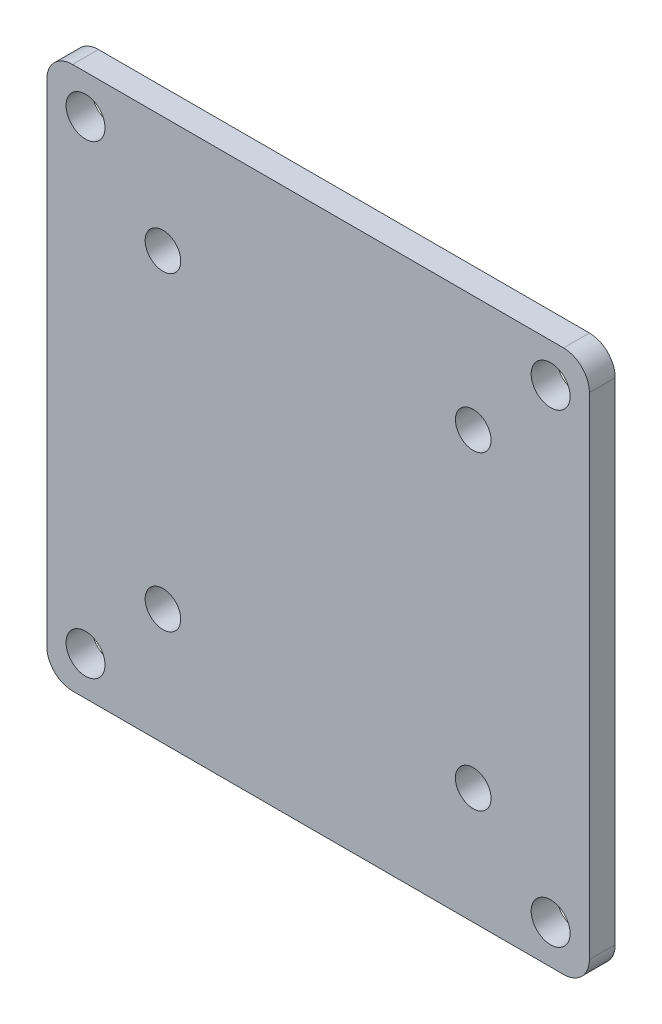
ISO-10303-21;
HEADER;
FILE_DESCRIPTION(('STEP AP214'),'2;1');
FILE_NAME('part.step','',(''),(''),'','','');
FILE_SCHEMA(('AUTOMOTIVE_DESIGN { 1 0 10303 214 1 1 1 1 }'));
ENDSEC;
DATA;
#1=APPLICATION_CONTEXT('core data for automotive mechanical design processes');
#2=APPLICATION_PROTOCOL_DEFINITION('international standard','automotive_design',2000,#1);
#3=PRODUCT_CONTEXT('',#1,'mechanical');
#4=PRODUCT('Part','Part','',(#3));
#5=PRODUCT_RELATED_PRODUCT_CATEGORY('part','',(#4));
#6=PRODUCT_DEFINITION_FORMATION('','',#4);
#7=PRODUCT_DEFINITION_CONTEXT('part definition',#1,'design');
#8=PRODUCT_DEFINITION('design','',#6,#7);
#9=PRODUCT_DEFINITION_SHAPE('','',#8);
#10=(LENGTH_UNIT() NAMED_UNIT(*) SI_UNIT(.MILLI.,.METRE.));
#11=(NAMED_UNIT(*) PLANE_ANGLE_UNIT() SI_UNIT($,.RADIAN.));
#12=(NAMED_UNIT(*) SI_UNIT($,.STERADIAN.) SOLID_ANGLE_UNIT());
#13=UNCERTAINTY_MEASURE_WITH_UNIT(LENGTH_MEASURE(1.E-05),#10,'distance_accuracy_value','');
#14=(GEOMETRIC_REPRESENTATION_CONTEXT(3) GLOBAL_UNCERTAINTY_ASSIGNED_CONTEXT((#13)) GLOBAL_UNIT_ASSIGNED_CONTEXT((#10,
#11,#12)) REPRESENTATION_CONTEXT('',''));
#15=CARTESIAN_POINT('',(0.,0.,0.));
#16=DIRECTION('',(0.,0.,1.));
#17=DIRECTION('',(1.,0.,0.));
#18=AXIS2_PLACEMENT_3D('',#15,#16,#17);
#19=CARTESIAN_POINT('',(0.,0.,2.54));
#20=DIRECTION('',(0.,0.,1.));
#21=DIRECTION('',(1.,0.,0.));
#22=AXIS2_PLACEMENT_3D('',#19,#20,#21);
#23=PLANE('',#22);
#24=CARTESIAN_POINT('',(15.2499999999999,15.25,2.54));
#25=DIRECTION('',(0.,0.,1.));
#26=DIRECTION('',(1.,0.,0.));
#27=AXIS2_PLACEMENT_3D('',#24,#25,#26);
#28=CIRCLE('',#27,1.75);
#29=CARTESIAN_POINT('',(16.9999999999999,15.25,2.54));
#30=VERTEX_POINT('',#29);
#31=EDGE_CURVE('E220',#30,#30,#28,.T.);
#32=ORIENTED_EDGE('',*,*,#31,.F.);
#33=EDGE_LOOP('',(#32));
#34=FACE_BOUND('',#33,.T.);
#35=CARTESIAN_POINT('',(-15.2500000000002,15.25,2.54));
#36=DIRECTION('',(0.,0.,1.));
#37=DIRECTION('',(1.,0.,0.));
#38=AXIS2_PLACEMENT_3D('',#35,#36,#37);
#39=CIRCLE('',#38,1.75);
#40=CARTESIAN_POINT('',(-13.5000000000002,15.25,2.54));
#41=VERTEX_POINT('',#40);
#42=EDGE_CURVE('E208',#41,#41,#39,.T.);
#43=ORIENTED_EDGE('',*,*,#42,.F.);
#44=EDGE_LOOP('',(#43));
#45=FACE_BOUND('',#44,.T.);
#46=CARTESIAN_POINT('',(-22.86,22.86,2.54));
#47=DIRECTION('',(0.,0.,1.));
#48=DIRECTION('',(1.,0.,0.));
#49=AXIS2_PLACEMENT_3D('',#46,#47,#48);
#50=CIRCLE('',#49,1.9145);
#51=CARTESIAN_POINT('',(-20.9455,22.86,2.54));
#52=VERTEX_POINT('',#51);
#53=EDGE_CURVE('E196',#52,#52,#50,.T.);
#54=ORIENTED_EDGE('',*,*,#53,.F.);
#55=EDGE_LOOP('',(#54));
#56=FACE_BOUND('',#55,.T.);
#57=CARTESIAN_POINT('',(22.86,-22.86,2.54));
#58=DIRECTION('',(0.,0.,1.));
#59=DIRECTION('',(1.,0.,0.));
#60=AXIS2_PLACEMENT_3D('',#57,#58,#59);
#61=CIRCLE('',#60,1.9145);
#62=CARTESIAN_POINT('',(24.7745,-22.86,2.54));
#63=VERTEX_POINT('',#62);
#64=EDGE_CURVE('E142',#63,#63,#61,.T.);
#65=ORIENTED_EDGE('',*,*,#64,.F.);
#66=EDGE_LOOP('',(#65));
#67=FACE_BOUND('',#66,.T.);
#68=DIRECTION('',(1.,0.,0.));
#69=VECTOR('',#68,1.);
#70=CARTESIAN_POINT('',(26.67,-26.67,2.54));
#71=LINE('',#70,#69);
#72=CARTESIAN_POINT('',(-24.13,-26.67,2.54));
#73=VERTEX_POINT('',#72);
#74=CARTESIAN_POINT('',(24.13,-26.67,2.54));
#75=VERTEX_POINT('',#74);
#76=EDGE_CURVE('E147',#73,#75,#71,.T.);
#77=ORIENTED_EDGE('',*,*,#76,.T.);
#78=CARTESIAN_POINT('',(24.13,-24.13,2.54));
#79=DIRECTION('',(0.,0.,1.));
#80=DIRECTION('',(1.,0.,0.));
#81=AXIS2_PLACEMENT_3D('',#78,#79,#80);
#82=CIRCLE('',#81,2.54);
#83=CARTESIAN_POINT('',(26.67,-24.13,2.54));
#84=VERTEX_POINT('',#83);
#85=EDGE_CURVE('E162',#75,#84,#82,.T.);
#86=ORIENTED_EDGE('',*,*,#85,.T.);
#87=DIRECTION('',(0.,1.,0.));
#88=VECTOR('',#87,1.);
#89=CARTESIAN_POINT('',(26.67,26.67,2.54));
#90=LINE('',#89,#88);
#91=CARTESIAN_POINT('',(26.67,24.13,2.54));
#92=VERTEX_POINT('',#91);
#93=EDGE_CURVE('E129',#84,#92,#90,.T.);
#94=ORIENTED_EDGE('',*,*,#93,.T.);
#95=CARTESIAN_POINT('',(24.13,24.13,2.54));
#96=DIRECTION('',(0.,0.,1.));
#97=DIRECTION('',(1.,0.,0.));
#98=AXIS2_PLACEMENT_3D('',#95,#96,#97);
#99=CIRCLE('',#98,2.54);
#100=CARTESIAN_POINT('',(24.13,26.67,2.54));
#101=VERTEX_POINT('',#100);
#102=EDGE_CURVE('E157',#92,#101,#99,.T.);
#103=ORIENTED_EDGE('',*,*,#102,.T.);
#104=DIRECTION('',(-1.,0.,0.));
#105=VECTOR('',#104,1.);
#106=CARTESIAN_POINT('',(26.67,26.67,2.54));
#107=LINE('',#106,#105);
#108=CARTESIAN_POINT('',(-24.13,26.67,2.54));
#109=VERTEX_POINT('',#108);
#110=EDGE_CURVE('E173',#101,#109,#107,.T.);
#111=ORIENTED_EDGE('',*,*,#110,.T.);
#112=CARTESIAN_POINT('',(-24.13,24.13,2.54));
#113=DIRECTION('',(0.,0.,1.));
#114=DIRECTION('',(1.,0.,0.));
#115=AXIS2_PLACEMENT_3D('',#112,#113,#114);
#116=CIRCLE('',#115,2.54);
#117=CARTESIAN_POINT('',(-26.67,24.13,2.54));
#118=VERTEX_POINT('',#117);
#119=EDGE_CURVE('E65',#109,#118,#116,.T.);
#120=ORIENTED_EDGE('',*,*,#119,.T.);
#121=DIRECTION('',(0.,-1.,0.));
#122=VECTOR('',#121,1.);
#123=CARTESIAN_POINT('',(-26.67,26.67,2.54));
#124=LINE('',#123,#122);
#125=CARTESIAN_POINT('',(-26.67,-24.13,2.54));
#126=VERTEX_POINT('',#125);
#127=EDGE_CURVE('E148',#118,#126,#124,.T.);
#128=ORIENTED_EDGE('',*,*,#127,.T.);
#129=CARTESIAN_POINT('',(-24.13,-24.13,2.54));
#130=DIRECTION('',(0.,0.,1.));
#131=DIRECTION('',(1.,0.,0.));
#132=AXIS2_PLACEMENT_3D('',#129,#130,#131);
#133=CIRCLE('',#132,2.54);
#134=EDGE_CURVE('E160',#126,#73,#133,.T.);
#135=ORIENTED_EDGE('',*,*,#134,.T.);
#136=EDGE_LOOP('',(#77,#86,#94,#103,#111,#120,#128,#135));
#137=FACE_BOUND('',#136,.T.);
#138=CARTESIAN_POINT('',(22.86,22.86,2.54));
#139=DIRECTION('',(0.,0.,1.));
#140=DIRECTION('',(1.,0.,0.));
#141=AXIS2_PLACEMENT_3D('',#138,#139,#140);
#142=CIRCLE('',#141,1.9145);
#143=CARTESIAN_POINT('',(24.7745,22.86,2.54));
#144=VERTEX_POINT('',#143);
#145=EDGE_CURVE('E190',#144,#144,#142,.T.);
#146=ORIENTED_EDGE('',*,*,#145,.F.);
#147=EDGE_LOOP('',(#146));
#148=FACE_BOUND('',#147,.T.);
#149=CARTESIAN_POINT('',(-22.86,-22.86,2.54));
#150=DIRECTION('',(0.,0.,1.));
#151=DIRECTION('',(1.,0.,0.));
#152=AXIS2_PLACEMENT_3D('',#149,#150,#151);
#153=CIRCLE('',#152,1.9145);
#154=CARTESIAN_POINT('',(-20.9455,-22.86,2.54));
#155=VERTEX_POINT('',#154);
#156=EDGE_CURVE('E202',#155,#155,#153,.T.);
#157=ORIENTED_EDGE('',*,*,#156,.F.);
#158=EDGE_LOOP('',(#157));
#159=FACE_BOUND('',#158,.T.);
#160=CARTESIAN_POINT('',(-15.2500000000002,-15.25,2.54));
#161=DIRECTION('',(0.,0.,1.));
#162=DIRECTION('',(1.,0.,0.));
#163=AXIS2_PLACEMENT_3D('',#160,#161,#162);
#164=CIRCLE('',#163,1.75);
#165=CARTESIAN_POINT('',(-13.5000000000002,-15.25,2.54));
#166=VERTEX_POINT('',#165);
#167=EDGE_CURVE('E214',#166,#166,#164,.T.);
#168=ORIENTED_EDGE('',*,*,#167,.F.);
#169=EDGE_LOOP('',(#168));
#170=FACE_BOUND('',#169,.T.);
#171=CARTESIAN_POINT('',(15.2499999999999,-15.25,2.54));
#172=DIRECTION('',(0.,0.,1.));
#173=DIRECTION('',(1.,0.,0.));
#174=AXIS2_PLACEMENT_3D('',#171,#172,#173);
#175=CIRCLE('',#174,1.75);
#176=CARTESIAN_POINT('',(16.9999999999999,-15.25,2.54));
#177=VERTEX_POINT('',#176);
#178=EDGE_CURVE('E226',#177,#177,#175,.T.);
#179=ORIENTED_EDGE('',*,*,#178,.F.);
#180=EDGE_LOOP('',(#179));
#181=FACE_BOUND('',#180,.T.);
#182=ADVANCED_FACE('F43',(#34,#45,#56,#67,#137,#148,#159,#170,#181),#23,.T.);
#183=CARTESIAN_POINT('',(0.,0.,0.));
#184=DIRECTION('',(0.,0.,1.));
#185=DIRECTION('',(1.,0.,0.));
#186=AXIS2_PLACEMENT_3D('',#183,#184,#185);
#187=PLANE('',#186);
#188=DIRECTION('',(0.,1.,0.));
#189=VECTOR('',#188,1.);
#190=CARTESIAN_POINT('',(26.67,26.67,0.));
#191=LINE('',#190,#189);
#192=CARTESIAN_POINT('',(26.67,-24.13,0.));
#193=VERTEX_POINT('',#192);
#194=CARTESIAN_POINT('',(26.67,24.13,0.));
#195=VERTEX_POINT('',#194);
#196=EDGE_CURVE('E126',#193,#195,#191,.T.);
#197=ORIENTED_EDGE('',*,*,#196,.F.);
#198=CARTESIAN_POINT('',(24.13,-24.13,0.));
#199=DIRECTION('',(0.,0.,1.));
#200=DIRECTION('',(1.,0.,0.));
#201=AXIS2_PLACEMENT_3D('',#198,#199,#200);
#202=CIRCLE('',#201,2.54);
#203=CARTESIAN_POINT('',(24.13,-26.67,0.));
#204=VERTEX_POINT('',#203);
#205=EDGE_CURVE('E109',#193,#204,#202,.F.);
#206=ORIENTED_EDGE('',*,*,#205,.T.);
#207=DIRECTION('',(1.,0.,0.));
#208=VECTOR('',#207,1.);
#209=CARTESIAN_POINT('',(26.67,-26.67,0.));
#210=LINE('',#209,#208);
#211=CARTESIAN_POINT('',(-24.13,-26.67,0.));
#212=VERTEX_POINT('',#211);
#213=EDGE_CURVE('E137',#212,#204,#210,.T.);
#214=ORIENTED_EDGE('',*,*,#213,.F.);
#215=CARTESIAN_POINT('',(-24.13,-24.13,0.));
#216=DIRECTION('',(0.,0.,1.));
#217=DIRECTION('',(1.,0.,0.));
#218=AXIS2_PLACEMENT_3D('',#215,#216,#217);
#219=CIRCLE('',#218,2.54);
#220=CARTESIAN_POINT('',(-26.67,-24.13,0.));
#221=VERTEX_POINT('',#220);
#222=EDGE_CURVE('E120',#212,#221,#219,.F.);
#223=ORIENTED_EDGE('',*,*,#222,.T.);
#224=DIRECTION('',(0.,-1.,0.));
#225=VECTOR('',#224,1.);
#226=CARTESIAN_POINT('',(-26.67,26.67,0.));
#227=LINE('',#226,#225);
#228=CARTESIAN_POINT('',(-26.67,24.13,0.));
#229=VERTEX_POINT('',#228);
#230=EDGE_CURVE('E140',#229,#221,#227,.T.);
#231=ORIENTED_EDGE('',*,*,#230,.F.);
#232=CARTESIAN_POINT('',(-24.13,24.13,0.));
#233=DIRECTION('',(0.,0.,1.));
#234=DIRECTION('',(1.,0.,0.));
#235=AXIS2_PLACEMENT_3D('',#232,#233,#234);
#236=CIRCLE('',#235,2.54);
#237=CARTESIAN_POINT('',(-24.13,26.67,0.));
#238=VERTEX_POINT('',#237);
#239=EDGE_CURVE('E151',#229,#238,#236,.F.);
#240=ORIENTED_EDGE('',*,*,#239,.T.);
#241=DIRECTION('',(-1.,0.,0.));
#242=VECTOR('',#241,1.);
#243=CARTESIAN_POINT('',(26.67,26.67,0.));
#244=LINE('',#243,#242);
#245=CARTESIAN_POINT('',(24.13,26.67,0.));
#246=VERTEX_POINT('',#245);
#247=EDGE_CURVE('E136',#246,#238,#244,.T.);
#248=ORIENTED_EDGE('',*,*,#247,.F.);
#249=CARTESIAN_POINT('',(24.13,24.13,0.));
#250=DIRECTION('',(0.,0.,1.));
#251=DIRECTION('',(1.,0.,0.));
#252=AXIS2_PLACEMENT_3D('',#249,#250,#251);
#253=CIRCLE('',#252,2.54);
#254=EDGE_CURVE('E130',#246,#195,#253,.F.);
#255=ORIENTED_EDGE('',*,*,#254,.T.);
#256=EDGE_LOOP('',(#197,#206,#214,#223,#231,#240,#248,#255));
#257=FACE_BOUND('',#256,.T.);
#258=CARTESIAN_POINT('',(22.86,-22.86,0.));
#259=DIRECTION('',(0.,0.,1.));
#260=DIRECTION('',(1.,0.,0.));
#261=AXIS2_PLACEMENT_3D('',#258,#259,#260);
#262=CIRCLE('',#261,1.9145);
#263=CARTESIAN_POINT('',(24.7745,-22.86,0.));
#264=VERTEX_POINT('',#263);
#265=EDGE_CURVE('E187',#264,#264,#262,.T.);
#266=ORIENTED_EDGE('',*,*,#265,.T.);
#267=EDGE_LOOP('',(#266));
#268=FACE_BOUND('',#267,.T.);
#269=CARTESIAN_POINT('',(22.86,22.86,0.));
#270=DIRECTION('',(0.,0.,1.));
#271=DIRECTION('',(1.,0.,0.));
#272=AXIS2_PLACEMENT_3D('',#269,#270,#271);
#273=CIRCLE('',#272,1.9145);
#274=CARTESIAN_POINT('',(24.7745,22.86,0.));
#275=VERTEX_POINT('',#274);
#276=EDGE_CURVE('E193',#275,#275,#273,.T.);
#277=ORIENTED_EDGE('',*,*,#276,.T.);
#278=EDGE_LOOP('',(#277));
#279=FACE_BOUND('',#278,.T.);
#280=CARTESIAN_POINT('',(-22.86,22.86,0.));
#281=DIRECTION('',(0.,0.,1.));
#282=DIRECTION('',(1.,0.,0.));
#283=AXIS2_PLACEMENT_3D('',#280,#281,#282);
#284=CIRCLE('',#283,1.9145);
#285=CARTESIAN_POINT('',(-20.9455,22.86,0.));
#286=VERTEX_POINT('',#285);
#287=EDGE_CURVE('E199',#286,#286,#284,.T.);
#288=ORIENTED_EDGE('',*,*,#287,.T.);
#289=EDGE_LOOP('',(#288));
#290=FACE_BOUND('',#289,.T.);
#291=CARTESIAN_POINT('',(-22.86,-22.86,0.));
#292=DIRECTION('',(0.,0.,1.));
#293=DIRECTION('',(1.,0.,0.));
#294=AXIS2_PLACEMENT_3D('',#291,#292,#293);
#295=CIRCLE('',#294,1.9145);
#296=CARTESIAN_POINT('',(-20.9455,-22.86,0.));
#297=VERTEX_POINT('',#296);
#298=EDGE_CURVE('E205',#297,#297,#295,.T.);
#299=ORIENTED_EDGE('',*,*,#298,.T.);
#300=EDGE_LOOP('',(#299));
#301=FACE_BOUND('',#300,.T.);
#302=CARTESIAN_POINT('',(-15.2500000000002,15.25,0.));
#303=DIRECTION('',(0.,0.,1.));
#304=DIRECTION('',(1.,0.,0.));
#305=AXIS2_PLACEMENT_3D('',#302,#303,#304);
#306=CIRCLE('',#305,1.75);
#307=CARTESIAN_POINT('',(-13.5000000000002,15.25,0.));
#308=VERTEX_POINT('',#307);
#309=EDGE_CURVE('E211',#308,#308,#306,.T.);
#310=ORIENTED_EDGE('',*,*,#309,.T.);
#311=EDGE_LOOP('',(#310));
#312=FACE_BOUND('',#311,.T.);
#313=CARTESIAN_POINT('',(-15.2500000000002,-15.25,0.));
#314=DIRECTION('',(0.,0.,1.));
#315=DIRECTION('',(1.,0.,0.));
#316=AXIS2_PLACEMENT_3D('',#313,#314,#315);
#317=CIRCLE('',#316,1.75);
#318=CARTESIAN_POINT('',(-13.5000000000002,-15.25,0.));
#319=VERTEX_POINT('',#318);
#320=EDGE_CURVE('E217',#319,#319,#317,.T.);
#321=ORIENTED_EDGE('',*,*,#320,.T.);
#322=EDGE_LOOP('',(#321));
#323=FACE_BOUND('',#322,.T.);
#324=CARTESIAN_POINT('',(15.2499999999999,15.25,0.));
#325=DIRECTION('',(0.,0.,1.));
#326=DIRECTION('',(1.,0.,0.));
#327=AXIS2_PLACEMENT_3D('',#324,#325,#326);
#328=CIRCLE('',#327,1.75);
#329=CARTESIAN_POINT('',(16.9999999999999,15.25,0.));
#330=VERTEX_POINT('',#329);
#331=EDGE_CURVE('E223',#330,#330,#328,.T.);
#332=ORIENTED_EDGE('',*,*,#331,.T.);
#333=EDGE_LOOP('',(#332));
#334=FACE_BOUND('',#333,.T.);
#335=CARTESIAN_POINT('',(15.2499999999999,-15.25,0.));
#336=DIRECTION('',(0.,0.,1.));
#337=DIRECTION('',(1.,0.,0.));
#338=AXIS2_PLACEMENT_3D('',#335,#336,#337);
#339=CIRCLE('',#338,1.75);
#340=CARTESIAN_POINT('',(16.9999999999999,-15.25,0.));
#341=VERTEX_POINT('',#340);
#342=EDGE_CURVE('E229',#341,#341,#339,.T.);
#343=ORIENTED_EDGE('',*,*,#342,.T.);
#344=EDGE_LOOP('',(#343));
#345=FACE_BOUND('',#344,.T.);
#346=ADVANCED_FACE('F133',(#257,#268,#279,#290,#301,#312,#323,#334,#345),#187,.F.);
#347=CARTESIAN_POINT('',(26.67,-26.67,2.54));
#348=DIRECTION('',(0.,1.,0.));
#349=DIRECTION('',(0.,0.,1.));
#350=AXIS2_PLACEMENT_3D('',#347,#348,#349);
#351=PLANE('',#350);
#352=ORIENTED_EDGE('',*,*,#213,.T.);
#353=DIRECTION('',(0.,0.,-1.));
#354=VECTOR('',#353,1.);
#355=CARTESIAN_POINT('',(24.13,-26.67,2.54));
#356=LINE('',#355,#354);
#357=EDGE_CURVE('E114',#204,#75,#356,.F.);
#358=ORIENTED_EDGE('',*,*,#357,.T.);
#359=ORIENTED_EDGE('',*,*,#76,.F.);
#360=DIRECTION('',(0.,0.,-1.));
#361=VECTOR('',#360,1.);
#362=CARTESIAN_POINT('',(-24.13,-26.67,2.54));
#363=LINE('',#362,#361);
#364=EDGE_CURVE('E119',#73,#212,#363,.T.);
#365=ORIENTED_EDGE('',*,*,#364,.T.);
#366=EDGE_LOOP('',(#352,#358,#359,#365));
#367=FACE_BOUND('',#366,.T.);
#368=ADVANCED_FACE('F245',(#367),#351,.F.);
#369=CARTESIAN_POINT('',(26.67,26.67,2.54));
#370=DIRECTION('',(-1.,0.,0.));
#371=DIRECTION('',(0.,-1.,0.));
#372=AXIS2_PLACEMENT_3D('',#369,#370,#371);
#373=PLANE('',#372);
#374=ORIENTED_EDGE('',*,*,#93,.F.);
#375=DIRECTION('',(0.,0.,-1.));
#376=VECTOR('',#375,1.);
#377=CARTESIAN_POINT('',(26.67,-24.13,2.54));
#378=LINE('',#377,#376);
#379=EDGE_CURVE('E113',#84,#193,#378,.T.);
#380=ORIENTED_EDGE('',*,*,#379,.T.);
#381=ORIENTED_EDGE('',*,*,#196,.T.);
#382=DIRECTION('',(0.,0.,-1.));
#383=VECTOR('',#382,1.);
#384=CARTESIAN_POINT('',(26.67,24.13,2.54));
#385=LINE('',#384,#383);
#386=EDGE_CURVE('E131',#195,#92,#385,.F.);
#387=ORIENTED_EDGE('',*,*,#386,.T.);
#388=EDGE_LOOP('',(#374,#380,#381,#387));
#389=FACE_BOUND('',#388,.T.);
#390=ADVANCED_FACE('F125',(#389),#373,.F.);
#391=CARTESIAN_POINT('',(26.67,26.67,2.54));
#392=DIRECTION('',(0.,-1.,0.));
#393=DIRECTION('',(0.,0.,-1.));
#394=AXIS2_PLACEMENT_3D('',#391,#392,#393);
#395=PLANE('',#394);
#396=ORIENTED_EDGE('',*,*,#247,.T.);
#397=DIRECTION('',(0.,0.,-1.));
#398=VECTOR('',#397,1.);
#399=CARTESIAN_POINT('',(-24.13,26.67,2.54));
#400=LINE('',#399,#398);
#401=EDGE_CURVE('E11',#238,#109,#400,.F.);
#402=ORIENTED_EDGE('',*,*,#401,.T.);
#403=ORIENTED_EDGE('',*,*,#110,.F.);
#404=DIRECTION('',(0.,0.,-1.));
#405=VECTOR('',#404,1.);
#406=CARTESIAN_POINT('',(24.13,26.67,2.54));
#407=LINE('',#406,#405);
#408=EDGE_CURVE('E51',#101,#246,#407,.T.);
#409=ORIENTED_EDGE('',*,*,#408,.T.);
#410=EDGE_LOOP('',(#396,#402,#403,#409));
#411=FACE_BOUND('',#410,.T.);
#412=ADVANCED_FACE('F171',(#411),#395,.F.);
#413=CARTESIAN_POINT('',(-26.67,26.67,2.54));
#414=DIRECTION('',(1.,0.,0.));
#415=DIRECTION('',(0.,1.,0.));
#416=AXIS2_PLACEMENT_3D('',#413,#414,#415);
#417=PLANE('',#416);
#418=ORIENTED_EDGE('',*,*,#230,.T.);
#419=DIRECTION('',(0.,0.,-1.));
#420=VECTOR('',#419,1.);
#421=CARTESIAN_POINT('',(-26.67,-24.13,2.54));
#422=LINE('',#421,#420);
#423=EDGE_CURVE('E58',#221,#126,#422,.F.);
#424=ORIENTED_EDGE('',*,*,#423,.T.);
#425=ORIENTED_EDGE('',*,*,#127,.F.);
#426=DIRECTION('',(0.,0.,-1.));
#427=VECTOR('',#426,1.);
#428=CARTESIAN_POINT('',(-26.67,24.13,2.54));
#429=LINE('',#428,#427);
#430=EDGE_CURVE('E164',#118,#229,#429,.T.);
#431=ORIENTED_EDGE('',*,*,#430,.T.);
#432=EDGE_LOOP('',(#418,#424,#425,#431));
#433=FACE_BOUND('',#432,.T.);
#434=ADVANCED_FACE('F180',(#433),#417,.F.);
#435=CARTESIAN_POINT('',(22.86,-22.86,2.54));
#436=DIRECTION('',(0.,0.,-1.));
#437=DIRECTION('',(-1.,0.,0.));
#438=AXIS2_PLACEMENT_3D('',#435,#436,#437);
#439=CYLINDRICAL_SURFACE('',#438,1.9145);
#440=ORIENTED_EDGE('',*,*,#64,.T.);
#441=EDGE_LOOP('',(#440));
#442=FACE_BOUND('',#441,.T.);
#443=ORIENTED_EDGE('',*,*,#265,.F.);
#444=EDGE_LOOP('',(#443));
#445=FACE_BOUND('',#444,.T.);
#446=ADVANCED_FACE('F250',(#442,#445),#439,.F.);
#447=CARTESIAN_POINT('',(22.86,22.86,2.54));
#448=DIRECTION('',(0.,0.,-1.));
#449=DIRECTION('',(-1.,0.,0.));
#450=AXIS2_PLACEMENT_3D('',#447,#448,#449);
#451=CYLINDRICAL_SURFACE('',#450,1.9145);
#452=ORIENTED_EDGE('',*,*,#145,.T.);
#453=EDGE_LOOP('',(#452));
#454=FACE_BOUND('',#453,.T.);
#455=ORIENTED_EDGE('',*,*,#276,.F.);
#456=EDGE_LOOP('',(#455));
#457=FACE_BOUND('',#456,.T.);
#458=ADVANCED_FACE('F310',(#454,#457),#451,.F.);
#459=CARTESIAN_POINT('',(-22.86,22.86,2.54));
#460=DIRECTION('',(0.,0.,-1.));
#461=DIRECTION('',(-1.,0.,0.));
#462=AXIS2_PLACEMENT_3D('',#459,#460,#461);
#463=CYLINDRICAL_SURFACE('',#462,1.9145);
#464=ORIENTED_EDGE('',*,*,#53,.T.);
#465=EDGE_LOOP('',(#464));
#466=FACE_BOUND('',#465,.T.);
#467=ORIENTED_EDGE('',*,*,#287,.F.);
#468=EDGE_LOOP('',(#467));
#469=FACE_BOUND('',#468,.T.);
#470=ADVANCED_FACE('F307',(#466,#469),#463,.F.);
#471=CARTESIAN_POINT('',(-22.86,-22.86,2.54));
#472=DIRECTION('',(0.,0.,-1.));
#473=DIRECTION('',(-1.,0.,0.));
#474=AXIS2_PLACEMENT_3D('',#471,#472,#473);
#475=CYLINDRICAL_SURFACE('',#474,1.9145);
#476=ORIENTED_EDGE('',*,*,#156,.T.);
#477=EDGE_LOOP('',(#476));
#478=FACE_BOUND('',#477,.T.);
#479=ORIENTED_EDGE('',*,*,#298,.F.);
#480=EDGE_LOOP('',(#479));
#481=FACE_BOUND('',#480,.T.);
#482=ADVANCED_FACE('F303',(#478,#481),#475,.F.);
#483=CARTESIAN_POINT('',(-15.2500000000002,15.25,2.54));
#484=DIRECTION('',(0.,0.,-1.));
#485=DIRECTION('',(-1.,0.,0.));
#486=AXIS2_PLACEMENT_3D('',#483,#484,#485);
#487=CYLINDRICAL_SURFACE('',#486,1.75);
#488=ORIENTED_EDGE('',*,*,#42,.T.);
#489=EDGE_LOOP('',(#488));
#490=FACE_BOUND('',#489,.T.);
#491=ORIENTED_EDGE('',*,*,#309,.F.);
#492=EDGE_LOOP('',(#491));
#493=FACE_BOUND('',#492,.T.);
#494=ADVANCED_FACE('F286',(#490,#493),#487,.F.);
#495=CARTESIAN_POINT('',(-15.2500000000002,-15.25,2.54));
#496=DIRECTION('',(0.,0.,-1.));
#497=DIRECTION('',(-1.,0.,0.));
#498=AXIS2_PLACEMENT_3D('',#495,#496,#497);
#499=CYLINDRICAL_SURFACE('',#498,1.75);
#500=ORIENTED_EDGE('',*,*,#167,.T.);
#501=EDGE_LOOP('',(#500));
#502=FACE_BOUND('',#501,.T.);
#503=ORIENTED_EDGE('',*,*,#320,.F.);
#504=EDGE_LOOP('',(#503));
#505=FACE_BOUND('',#504,.T.);
#506=ADVANCED_FACE('F282',(#502,#505),#499,.F.);
#507=CARTESIAN_POINT('',(15.2499999999999,15.25,2.54));
#508=DIRECTION('',(0.,0.,-1.));
#509=DIRECTION('',(-1.,0.,0.));
#510=AXIS2_PLACEMENT_3D('',#507,#508,#509);
#511=CYLINDRICAL_SURFACE('',#510,1.75);
#512=ORIENTED_EDGE('',*,*,#31,.T.);
#513=EDGE_LOOP('',(#512));
#514=FACE_BOUND('',#513,.T.);
#515=ORIENTED_EDGE('',*,*,#331,.F.);
#516=EDGE_LOOP('',(#515));
#517=FACE_BOUND('',#516,.T.);
#518=ADVANCED_FACE('F285',(#514,#517),#511,.F.);
#519=CARTESIAN_POINT('',(15.2499999999999,-15.25,2.54));
#520=DIRECTION('',(0.,0.,-1.));
#521=DIRECTION('',(-1.,0.,0.));
#522=AXIS2_PLACEMENT_3D('',#519,#520,#521);
#523=CYLINDRICAL_SURFACE('',#522,1.75);
#524=ORIENTED_EDGE('',*,*,#178,.T.);
#525=EDGE_LOOP('',(#524));
#526=FACE_BOUND('',#525,.T.);
#527=ORIENTED_EDGE('',*,*,#342,.F.);
#528=EDGE_LOOP('',(#527));
#529=FACE_BOUND('',#528,.T.);
#530=ADVANCED_FACE('F235',(#526,#529),#523,.F.);
#531=CARTESIAN_POINT('',(24.13,-24.13,2.54));
#532=DIRECTION('',(0.,0.,-1.));
#533=DIRECTION('',(-1.,0.,0.));
#534=AXIS2_PLACEMENT_3D('',#531,#532,#533);
#535=CYLINDRICAL_SURFACE('',#534,2.54);
#536=ORIENTED_EDGE('',*,*,#85,.F.);
#537=ORIENTED_EDGE('',*,*,#357,.F.);
#538=ORIENTED_EDGE('',*,*,#205,.F.);
#539=ORIENTED_EDGE('',*,*,#379,.F.);
#540=EDGE_LOOP('',(#536,#537,#538,#539));
#541=FACE_BOUND('',#540,.T.);
#542=ADVANCED_FACE('F112',(#541),#535,.T.);
#543=CARTESIAN_POINT('',(-24.13,-24.13,2.54));
#544=DIRECTION('',(0.,0.,-1.));
#545=DIRECTION('',(-1.,0.,0.));
#546=AXIS2_PLACEMENT_3D('',#543,#544,#545);
#547=CYLINDRICAL_SURFACE('',#546,2.54);
#548=ORIENTED_EDGE('',*,*,#134,.F.);
#549=ORIENTED_EDGE('',*,*,#423,.F.);
#550=ORIENTED_EDGE('',*,*,#222,.F.);
#551=ORIENTED_EDGE('',*,*,#364,.F.);
#552=EDGE_LOOP('',(#548,#549,#550,#551));
#553=FACE_BOUND('',#552,.T.);
#554=ADVANCED_FACE('F264',(#553),#547,.T.);
#555=CARTESIAN_POINT('',(-24.13,24.13,2.54));
#556=DIRECTION('',(0.,0.,-1.));
#557=DIRECTION('',(-1.,0.,0.));
#558=AXIS2_PLACEMENT_3D('',#555,#556,#557);
#559=CYLINDRICAL_SURFACE('',#558,2.54);
#560=ORIENTED_EDGE('',*,*,#119,.F.);
#561=ORIENTED_EDGE('',*,*,#401,.F.);
#562=ORIENTED_EDGE('',*,*,#239,.F.);
#563=ORIENTED_EDGE('',*,*,#430,.F.);
#564=EDGE_LOOP('',(#560,#561,#562,#563));
#565=FACE_BOUND('',#564,.T.);
#566=ADVANCED_FACE('F179',(#565),#559,.T.);
#567=CARTESIAN_POINT('',(24.13,24.13,2.54));
#568=DIRECTION('',(0.,0.,-1.));
#569=DIRECTION('',(-1.,0.,0.));
#570=AXIS2_PLACEMENT_3D('',#567,#568,#569);
#571=CYLINDRICAL_SURFACE('',#570,2.54);
#572=ORIENTED_EDGE('',*,*,#102,.F.);
#573=ORIENTED_EDGE('',*,*,#386,.F.);
#574=ORIENTED_EDGE('',*,*,#254,.F.);
#575=ORIENTED_EDGE('',*,*,#408,.F.);
#576=EDGE_LOOP('',(#572,#573,#574,#575));
#577=FACE_BOUND('',#576,.T.);
#578=ADVANCED_FACE('F45',(#577),#571,.T.);
#579=CLOSED_SHELL('',(#182,#346,#368,#390,#412,#434,#446,#458,#470,#482,#494,#506,#518,#530,
#542,#554,#566,#578));
#580=MANIFOLD_SOLID_BREP('B2',#579);
#581=ADVANCED_BREP_SHAPE_REPRESENTATION('',(#18,#580),#14);
#582=SHAPE_DEFINITION_REPRESENTATION(#9,#581);
ENDSEC;
END-ISO-10303-21;
